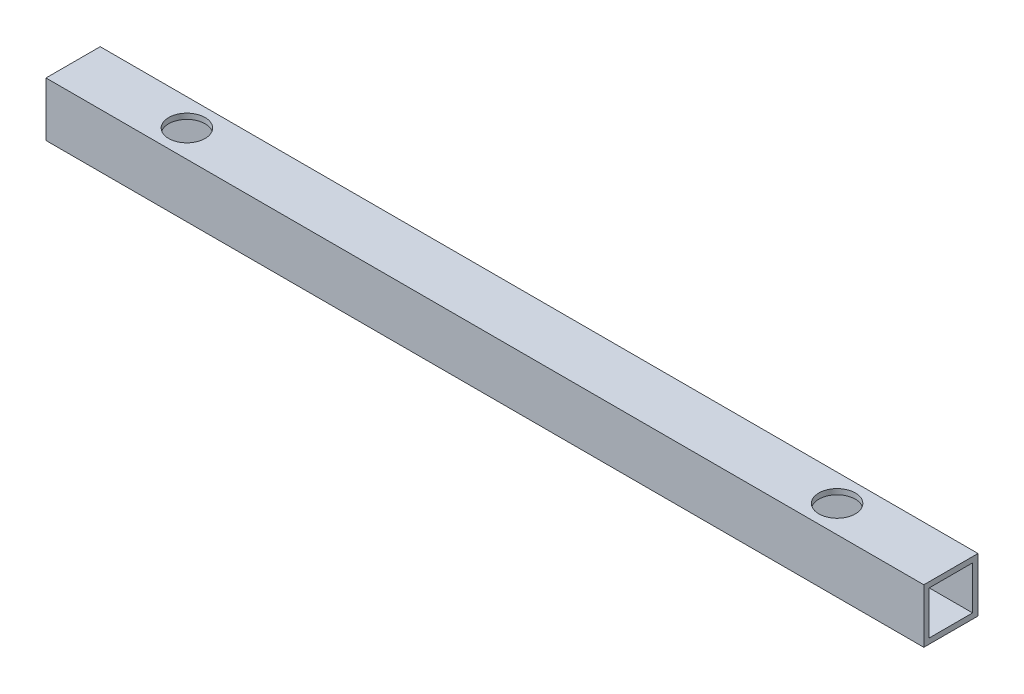
ISO-10303-21;
HEADER;
FILE_DESCRIPTION(('STEP AP214'),'2;1');
FILE_NAME('part.step','',(''),(''),'','','');
FILE_SCHEMA(('AUTOMOTIVE_DESIGN { 1 0 10303 214 1 1 1 1 }'));
ENDSEC;
DATA;
#1=APPLICATION_CONTEXT('core data for automotive mechanical design processes');
#2=APPLICATION_PROTOCOL_DEFINITION('international standard','automotive_design',2000,#1);
#3=PRODUCT_CONTEXT('',#1,'mechanical');
#4=PRODUCT('Part','Part','',(#3));
#5=PRODUCT_RELATED_PRODUCT_CATEGORY('part','',(#4));
#6=PRODUCT_DEFINITION_FORMATION('','',#4);
#7=PRODUCT_DEFINITION_CONTEXT('part definition',#1,'design');
#8=PRODUCT_DEFINITION('design','',#6,#7);
#9=PRODUCT_DEFINITION_SHAPE('','',#8);
#10=(LENGTH_UNIT() NAMED_UNIT(*) SI_UNIT(.MILLI.,.METRE.));
#11=(NAMED_UNIT(*) PLANE_ANGLE_UNIT() SI_UNIT($,.RADIAN.));
#12=(NAMED_UNIT(*) SI_UNIT($,.STERADIAN.) SOLID_ANGLE_UNIT());
#13=UNCERTAINTY_MEASURE_WITH_UNIT(LENGTH_MEASURE(1.E-05),#10,'distance_accuracy_value','');
#14=(GEOMETRIC_REPRESENTATION_CONTEXT(3) GLOBAL_UNCERTAINTY_ASSIGNED_CONTEXT((#13)) GLOBAL_UNIT_ASSIGNED_CONTEXT((#10,
#11,#12)) REPRESENTATION_CONTEXT('',''));
#15=CARTESIAN_POINT('',(0.,0.,0.));
#16=DIRECTION('',(0.,0.,1.));
#17=DIRECTION('',(1.,0.,0.));
#18=AXIS2_PLACEMENT_3D('',#15,#16,#17);
#19=CARTESIAN_POINT('',(66.675,0.,-15.875));
#20=DIRECTION('',(0.,1.,0.));
#21=DIRECTION('',(0.,0.,1.));
#22=AXIS2_PLACEMENT_3D('',#19,#20,#21);
#23=CYLINDRICAL_SURFACE('',#22,10.668);
#24=CARTESIAN_POINT('',(66.675,-28.575,-15.875));
#25=DIRECTION('',(0.,1.,0.));
#26=DIRECTION('',(0.,0.,1.));
#27=AXIS2_PLACEMENT_3D('',#24,#25,#26);
#28=CIRCLE('',#27,10.668);
#29=CARTESIAN_POINT('',(66.675,-28.575,-5.207));
#30=VERTEX_POINT('',#29);
#31=EDGE_CURVE('E20',#30,#30,#28,.F.);
#32=ORIENTED_EDGE('',*,*,#31,.F.);
#33=EDGE_LOOP('',(#32));
#34=FACE_BOUND('',#33,.T.);
#35=CARTESIAN_POINT('',(66.675,-31.75,-15.875));
#36=DIRECTION('',(0.,1.,0.));
#37=DIRECTION('',(0.,0.,1.));
#38=AXIS2_PLACEMENT_3D('',#35,#36,#37);
#39=CIRCLE('',#38,10.668);
#40=CARTESIAN_POINT('',(66.675,-31.75,-5.207));
#41=VERTEX_POINT('',#40);
#42=EDGE_CURVE('E120',#41,#41,#39,.T.);
#43=ORIENTED_EDGE('',*,*,#42,.F.);
#44=EDGE_LOOP('',(#43));
#45=FACE_BOUND('',#44,.T.);
#46=ADVANCED_FACE('F17',(#34,#45),#23,.F.);
#47=CARTESIAN_POINT('',(447.675,0.,-15.875));
#48=DIRECTION('',(0.,1.,0.));
#49=DIRECTION('',(0.,0.,1.));
#50=AXIS2_PLACEMENT_3D('',#47,#48,#49);
#51=CYLINDRICAL_SURFACE('',#50,10.668);
#52=CARTESIAN_POINT('',(447.675,-28.575,-15.875));
#53=DIRECTION('',(0.,1.,0.));
#54=DIRECTION('',(0.,0.,1.));
#55=AXIS2_PLACEMENT_3D('',#52,#53,#54);
#56=CIRCLE('',#55,10.668);
#57=CARTESIAN_POINT('',(447.675,-28.575,-5.207));
#58=VERTEX_POINT('',#57);
#59=EDGE_CURVE('E126',#58,#58,#56,.F.);
#60=ORIENTED_EDGE('',*,*,#59,.F.);
#61=EDGE_LOOP('',(#60));
#62=FACE_BOUND('',#61,.T.);
#63=CARTESIAN_POINT('',(447.675,-31.75,-15.875));
#64=DIRECTION('',(0.,1.,0.));
#65=DIRECTION('',(0.,0.,1.));
#66=AXIS2_PLACEMENT_3D('',#63,#64,#65);
#67=CIRCLE('',#66,10.668);
#68=CARTESIAN_POINT('',(447.675,-31.75,-5.207));
#69=VERTEX_POINT('',#68);
#70=EDGE_CURVE('E116',#69,#69,#67,.T.);
#71=ORIENTED_EDGE('',*,*,#70,.F.);
#72=EDGE_LOOP('',(#71));
#73=FACE_BOUND('',#72,.T.);
#74=ADVANCED_FACE('F153',(#62,#73),#51,.F.);
#75=CARTESIAN_POINT('',(66.675,0.,-15.875));
#76=DIRECTION('',(0.,1.,0.));
#77=DIRECTION('',(0.,0.,1.));
#78=AXIS2_PLACEMENT_3D('',#75,#76,#77);
#79=CYLINDRICAL_SURFACE('',#78,10.668);
#80=CARTESIAN_POINT('',(66.675,-3.175,-15.875));
#81=DIRECTION('',(0.,1.,0.));
#82=DIRECTION('',(0.,0.,1.));
#83=AXIS2_PLACEMENT_3D('',#80,#81,#82);
#84=CIRCLE('',#83,10.668);
#85=CARTESIAN_POINT('',(66.675,-3.175,-5.207));
#86=VERTEX_POINT('',#85);
#87=EDGE_CURVE('E91',#86,#86,#84,.T.);
#88=ORIENTED_EDGE('',*,*,#87,.F.);
#89=EDGE_LOOP('',(#88));
#90=FACE_BOUND('',#89,.T.);
#91=CARTESIAN_POINT('',(66.675,0.,-15.875));
#92=DIRECTION('',(0.,1.,0.));
#93=DIRECTION('',(0.,0.,1.));
#94=AXIS2_PLACEMENT_3D('',#91,#92,#93);
#95=CIRCLE('',#94,10.668);
#96=CARTESIAN_POINT('',(66.675,0.,-5.207));
#97=VERTEX_POINT('',#96);
#98=EDGE_CURVE('E131',#97,#97,#95,.F.);
#99=ORIENTED_EDGE('',*,*,#98,.F.);
#100=EDGE_LOOP('',(#99));
#101=FACE_BOUND('',#100,.T.);
#102=ADVANCED_FACE('F229',(#90,#101),#79,.F.);
#103=CARTESIAN_POINT('',(447.675,0.,-15.875));
#104=DIRECTION('',(0.,1.,0.));
#105=DIRECTION('',(0.,0.,1.));
#106=AXIS2_PLACEMENT_3D('',#103,#104,#105);
#107=CYLINDRICAL_SURFACE('',#106,10.668);
#108=CARTESIAN_POINT('',(447.675,-3.175,-15.875));
#109=DIRECTION('',(0.,1.,0.));
#110=DIRECTION('',(0.,0.,1.));
#111=AXIS2_PLACEMENT_3D('',#108,#109,#110);
#112=CIRCLE('',#111,10.668);
#113=CARTESIAN_POINT('',(447.675,-3.175,-5.207));
#114=VERTEX_POINT('',#113);
#115=EDGE_CURVE('E123',#114,#114,#112,.T.);
#116=ORIENTED_EDGE('',*,*,#115,.F.);
#117=EDGE_LOOP('',(#116));
#118=FACE_BOUND('',#117,.T.);
#119=CARTESIAN_POINT('',(447.675,0.,-15.875));
#120=DIRECTION('',(0.,1.,0.));
#121=DIRECTION('',(0.,0.,1.));
#122=AXIS2_PLACEMENT_3D('',#119,#120,#121);
#123=CIRCLE('',#122,10.668);
#124=CARTESIAN_POINT('',(447.675,0.,-5.207));
#125=VERTEX_POINT('',#124);
#126=EDGE_CURVE('E127',#125,#125,#123,.F.);
#127=ORIENTED_EDGE('',*,*,#126,.F.);
#128=EDGE_LOOP('',(#127));
#129=FACE_BOUND('',#128,.T.);
#130=ADVANCED_FACE('F225',(#118,#129),#107,.F.);
#131=CARTESIAN_POINT('',(0.,-31.75,-31.75));
#132=DIRECTION('',(0.,0.,-1.));
#133=DIRECTION('',(-1.,0.,0.));
#134=AXIS2_PLACEMENT_3D('',#131,#132,#133);
#135=PLANE('',#134);
#136=DIRECTION('',(1.,0.,0.));
#137=VECTOR('',#136,1.);
#138=CARTESIAN_POINT('',(0.,-31.75,-31.75));
#139=LINE('',#138,#137);
#140=CARTESIAN_POINT('',(0.,-31.75,-31.75));
#141=VERTEX_POINT('',#140);
#142=CARTESIAN_POINT('',(514.35,-31.75,-31.75));
#143=VERTEX_POINT('',#142);
#144=EDGE_CURVE('E117',#141,#143,#139,.T.);
#145=ORIENTED_EDGE('',*,*,#144,.F.);
#146=DIRECTION('',(0.,1.,0.));
#147=VECTOR('',#146,1.);
#148=CARTESIAN_POINT('',(0.,0.,-31.75));
#149=LINE('',#148,#147);
#150=CARTESIAN_POINT('',(0.,0.,-31.75));
#151=VERTEX_POINT('',#150);
#152=EDGE_CURVE('E176',#141,#151,#149,.T.);
#153=ORIENTED_EDGE('',*,*,#152,.T.);
#154=DIRECTION('',(1.,0.,0.));
#155=VECTOR('',#154,1.);
#156=CARTESIAN_POINT('',(0.,0.,-31.75));
#157=LINE('',#156,#155);
#158=CARTESIAN_POINT('',(514.35,0.,-31.75));
#159=VERTEX_POINT('',#158);
#160=EDGE_CURVE('E134',#159,#151,#157,.F.);
#161=ORIENTED_EDGE('',*,*,#160,.F.);
#162=DIRECTION('',(0.,1.,0.));
#163=VECTOR('',#162,1.);
#164=CARTESIAN_POINT('',(514.35,0.,-31.75));
#165=LINE('',#164,#163);
#166=EDGE_CURVE('E108',#143,#159,#165,.T.);
#167=ORIENTED_EDGE('',*,*,#166,.F.);
#168=EDGE_LOOP('',(#145,#153,#161,#167));
#169=FACE_BOUND('',#168,.T.);
#170=ADVANCED_FACE('F222',(#169),#135,.T.);
#171=CARTESIAN_POINT('',(0.,-28.575,-28.575));
#172=DIRECTION('',(0.,1.,0.));
#173=DIRECTION('',(0.,0.,1.));
#174=AXIS2_PLACEMENT_3D('',#171,#172,#173);
#175=PLANE('',#174);
#176=ORIENTED_EDGE('',*,*,#59,.T.);
#177=EDGE_LOOP('',(#176));
#178=FACE_BOUND('',#177,.T.);
#179=ORIENTED_EDGE('',*,*,#31,.T.);
#180=EDGE_LOOP('',(#179));
#181=FACE_BOUND('',#180,.T.);
#182=DIRECTION('',(1.,0.,0.));
#183=VECTOR('',#182,1.);
#184=CARTESIAN_POINT('',(0.,-28.575,-28.575));
#185=LINE('',#184,#183);
#186=CARTESIAN_POINT('',(0.,-28.575,-28.575));
#187=VERTEX_POINT('',#186);
#188=CARTESIAN_POINT('',(514.35,-28.575,-28.575));
#189=VERTEX_POINT('',#188);
#190=EDGE_CURVE('E122',#187,#189,#185,.T.);
#191=ORIENTED_EDGE('',*,*,#190,.F.);
#192=DIRECTION('',(0.,0.,-1.));
#193=VECTOR('',#192,1.);
#194=CARTESIAN_POINT('',(0.,-28.575,0.));
#195=LINE('',#194,#193);
#196=CARTESIAN_POINT('',(0.,-28.575,-3.175));
#197=VERTEX_POINT('',#196);
#198=EDGE_CURVE('E188',#187,#197,#195,.F.);
#199=ORIENTED_EDGE('',*,*,#198,.T.);
#200=DIRECTION('',(-1.,0.,0.));
#201=VECTOR('',#200,1.);
#202=CARTESIAN_POINT('',(0.,-28.575,-3.175));
#203=LINE('',#202,#201);
#204=CARTESIAN_POINT('',(514.35,-28.575,-3.175));
#205=VERTEX_POINT('',#204);
#206=EDGE_CURVE('E92',#205,#197,#203,.T.);
#207=ORIENTED_EDGE('',*,*,#206,.F.);
#208=DIRECTION('',(0.,0.,-1.));
#209=VECTOR('',#208,1.);
#210=CARTESIAN_POINT('',(514.35,-28.575,0.));
#211=LINE('',#210,#209);
#212=EDGE_CURVE('E107',#189,#205,#211,.F.);
#213=ORIENTED_EDGE('',*,*,#212,.F.);
#214=EDGE_LOOP('',(#191,#199,#207,#213));
#215=FACE_BOUND('',#214,.T.);
#216=ADVANCED_FACE('F148',(#178,#181,#215),#175,.T.);
#217=CARTESIAN_POINT('',(0.,-28.575,-3.175));
#218=DIRECTION('',(0.,0.,-1.));
#219=DIRECTION('',(-1.,0.,0.));
#220=AXIS2_PLACEMENT_3D('',#217,#218,#219);
#221=PLANE('',#220);
#222=ORIENTED_EDGE('',*,*,#206,.T.);
#223=DIRECTION('',(0.,1.,0.));
#224=VECTOR('',#223,1.);
#225=CARTESIAN_POINT('',(0.,0.,-3.175));
#226=LINE('',#225,#224);
#227=CARTESIAN_POINT('',(0.,-3.175,-3.175));
#228=VERTEX_POINT('',#227);
#229=EDGE_CURVE('E88',#197,#228,#226,.T.);
#230=ORIENTED_EDGE('',*,*,#229,.T.);
#231=DIRECTION('',(1.,0.,0.));
#232=VECTOR('',#231,1.);
#233=CARTESIAN_POINT('',(0.,-3.175,-3.175));
#234=LINE('',#233,#232);
#235=CARTESIAN_POINT('',(514.35,-3.175,-3.175));
#236=VERTEX_POINT('',#235);
#237=EDGE_CURVE('E80',#236,#228,#234,.F.);
#238=ORIENTED_EDGE('',*,*,#237,.F.);
#239=DIRECTION('',(0.,1.,0.));
#240=VECTOR('',#239,1.);
#241=CARTESIAN_POINT('',(514.35,0.,-3.175));
#242=LINE('',#241,#240);
#243=EDGE_CURVE('E85',#205,#236,#242,.T.);
#244=ORIENTED_EDGE('',*,*,#243,.F.);
#245=EDGE_LOOP('',(#222,#230,#238,#244));
#246=FACE_BOUND('',#245,.T.);
#247=ADVANCED_FACE('F83',(#246),#221,.T.);
#248=CARTESIAN_POINT('',(0.,-3.175,-3.175));
#249=DIRECTION('',(0.,-1.,0.));
#250=DIRECTION('',(0.,0.,-1.));
#251=AXIS2_PLACEMENT_3D('',#248,#249,#250);
#252=PLANE('',#251);
#253=ORIENTED_EDGE('',*,*,#115,.T.);
#254=EDGE_LOOP('',(#253));
#255=FACE_BOUND('',#254,.T.);
#256=ORIENTED_EDGE('',*,*,#87,.T.);
#257=EDGE_LOOP('',(#256));
#258=FACE_BOUND('',#257,.T.);
#259=ORIENTED_EDGE('',*,*,#237,.T.);
#260=DIRECTION('',(0.,0.,-1.));
#261=VECTOR('',#260,1.);
#262=CARTESIAN_POINT('',(0.,-3.175,0.));
#263=LINE('',#262,#261);
#264=CARTESIAN_POINT('',(0.,-3.175,-28.575));
#265=VERTEX_POINT('',#264);
#266=EDGE_CURVE('E185',#228,#265,#263,.T.);
#267=ORIENTED_EDGE('',*,*,#266,.T.);
#268=DIRECTION('',(1.,0.,0.));
#269=VECTOR('',#268,1.);
#270=CARTESIAN_POINT('',(0.,-3.175,-28.575));
#271=LINE('',#270,#269);
#272=CARTESIAN_POINT('',(514.35,-3.175,-28.575));
#273=VERTEX_POINT('',#272);
#274=EDGE_CURVE('E98',#273,#265,#271,.F.);
#275=ORIENTED_EDGE('',*,*,#274,.F.);
#276=DIRECTION('',(0.,0.,-1.));
#277=VECTOR('',#276,1.);
#278=CARTESIAN_POINT('',(514.35,-3.175,0.));
#279=LINE('',#278,#277);
#280=EDGE_CURVE('E95',#236,#273,#279,.T.);
#281=ORIENTED_EDGE('',*,*,#280,.F.);
#282=EDGE_LOOP('',(#259,#267,#275,#281));
#283=FACE_BOUND('',#282,.T.);
#284=ADVANCED_FACE('F96',(#255,#258,#283),#252,.T.);
#285=CARTESIAN_POINT('',(0.,-3.175,-28.575));
#286=DIRECTION('',(0.,0.,1.));
#287=DIRECTION('',(1.,0.,0.));
#288=AXIS2_PLACEMENT_3D('',#285,#286,#287);
#289=PLANE('',#288);
#290=ORIENTED_EDGE('',*,*,#274,.T.);
#291=DIRECTION('',(0.,1.,0.));
#292=VECTOR('',#291,1.);
#293=CARTESIAN_POINT('',(0.,0.,-28.575));
#294=LINE('',#293,#292);
#295=EDGE_CURVE('E171',#265,#187,#294,.F.);
#296=ORIENTED_EDGE('',*,*,#295,.T.);
#297=ORIENTED_EDGE('',*,*,#190,.T.);
#298=DIRECTION('',(0.,1.,0.));
#299=VECTOR('',#298,1.);
#300=CARTESIAN_POINT('',(514.35,0.,-28.575));
#301=LINE('',#300,#299);
#302=EDGE_CURVE('E102',#273,#189,#301,.F.);
#303=ORIENTED_EDGE('',*,*,#302,.F.);
#304=EDGE_LOOP('',(#290,#296,#297,#303));
#305=FACE_BOUND('',#304,.T.);
#306=ADVANCED_FACE('F159',(#305),#289,.T.);
#307=CARTESIAN_POINT('',(0.,-31.75,0.));
#308=DIRECTION('',(0.,-1.,0.));
#309=DIRECTION('',(0.,0.,-1.));
#310=AXIS2_PLACEMENT_3D('',#307,#308,#309);
#311=PLANE('',#310);
#312=ORIENTED_EDGE('',*,*,#70,.T.);
#313=EDGE_LOOP('',(#312));
#314=FACE_BOUND('',#313,.T.);
#315=ORIENTED_EDGE('',*,*,#42,.T.);
#316=EDGE_LOOP('',(#315));
#317=FACE_BOUND('',#316,.T.);
#318=DIRECTION('',(1.,0.,0.));
#319=VECTOR('',#318,1.);
#320=CARTESIAN_POINT('',(0.,-31.75,0.));
#321=LINE('',#320,#319);
#322=CARTESIAN_POINT('',(0.,-31.75,0.));
#323=VERTEX_POINT('',#322);
#324=CARTESIAN_POINT('',(514.35,-31.75,0.));
#325=VERTEX_POINT('',#324);
#326=EDGE_CURVE('E164',#323,#325,#321,.T.);
#327=ORIENTED_EDGE('',*,*,#326,.F.);
#328=DIRECTION('',(0.,0.,-1.));
#329=VECTOR('',#328,1.);
#330=CARTESIAN_POINT('',(0.,-31.75,0.));
#331=LINE('',#330,#329);
#332=EDGE_CURVE('E130',#323,#141,#331,.T.);
#333=ORIENTED_EDGE('',*,*,#332,.T.);
#334=ORIENTED_EDGE('',*,*,#144,.T.);
#335=DIRECTION('',(0.,0.,-1.));
#336=VECTOR('',#335,1.);
#337=CARTESIAN_POINT('',(514.35,-31.75,0.));
#338=LINE('',#337,#336);
#339=EDGE_CURVE('E110',#325,#143,#338,.T.);
#340=ORIENTED_EDGE('',*,*,#339,.F.);
#341=EDGE_LOOP('',(#327,#333,#334,#340));
#342=FACE_BOUND('',#341,.T.);
#343=ADVANCED_FACE('F156',(#314,#317,#342),#311,.T.);
#344=CARTESIAN_POINT('',(514.35,0.,0.));
#345=DIRECTION('',(1.,0.,0.));
#346=DIRECTION('',(0.,0.,-1.));
#347=AXIS2_PLACEMENT_3D('',#344,#345,#346);
#348=PLANE('',#347);
#349=ORIENTED_EDGE('',*,*,#302,.T.);
#350=ORIENTED_EDGE('',*,*,#212,.T.);
#351=ORIENTED_EDGE('',*,*,#243,.T.);
#352=ORIENTED_EDGE('',*,*,#280,.T.);
#353=EDGE_LOOP('',(#349,#350,#351,#352));
#354=FACE_BOUND('',#353,.T.);
#355=DIRECTION('',(0.,0.,1.));
#356=VECTOR('',#355,1.);
#357=CARTESIAN_POINT('',(514.35,0.,-31.75));
#358=LINE('',#357,#356);
#359=CARTESIAN_POINT('',(514.35,0.,0.));
#360=VERTEX_POINT('',#359);
#361=EDGE_CURVE('E193',#360,#159,#358,.F.);
#362=ORIENTED_EDGE('',*,*,#361,.F.);
#363=DIRECTION('',(0.,1.,0.));
#364=VECTOR('',#363,1.);
#365=CARTESIAN_POINT('',(514.35,0.,0.));
#366=LINE('',#365,#364);
#367=EDGE_CURVE('E170',#325,#360,#366,.T.);
#368=ORIENTED_EDGE('',*,*,#367,.F.);
#369=ORIENTED_EDGE('',*,*,#339,.T.);
#370=ORIENTED_EDGE('',*,*,#166,.T.);
#371=EDGE_LOOP('',(#362,#368,#369,#370));
#372=FACE_BOUND('',#371,.T.);
#373=ADVANCED_FACE('F104',(#354,#372),#348,.T.);
#374=CARTESIAN_POINT('',(0.,0.,-31.75));
#375=DIRECTION('',(0.,1.,0.));
#376=DIRECTION('',(0.,0.,1.));
#377=AXIS2_PLACEMENT_3D('',#374,#375,#376);
#378=PLANE('',#377);
#379=ORIENTED_EDGE('',*,*,#126,.T.);
#380=EDGE_LOOP('',(#379));
#381=FACE_BOUND('',#380,.T.);
#382=ORIENTED_EDGE('',*,*,#98,.T.);
#383=EDGE_LOOP('',(#382));
#384=FACE_BOUND('',#383,.T.);
#385=ORIENTED_EDGE('',*,*,#160,.T.);
#386=DIRECTION('',(0.,0.,-1.));
#387=VECTOR('',#386,1.);
#388=CARTESIAN_POINT('',(0.,0.,0.));
#389=LINE('',#388,#387);
#390=CARTESIAN_POINT('',(0.,0.,0.));
#391=VERTEX_POINT('',#390);
#392=EDGE_CURVE('E35',#151,#391,#389,.F.);
#393=ORIENTED_EDGE('',*,*,#392,.T.);
#394=DIRECTION('',(1.,0.,0.));
#395=VECTOR('',#394,1.);
#396=CARTESIAN_POINT('',(0.,0.,0.));
#397=LINE('',#396,#395);
#398=EDGE_CURVE('E26',#360,#391,#397,.F.);
#399=ORIENTED_EDGE('',*,*,#398,.F.);
#400=ORIENTED_EDGE('',*,*,#361,.T.);
#401=EDGE_LOOP('',(#385,#393,#399,#400));
#402=FACE_BOUND('',#401,.T.);
#403=ADVANCED_FACE('F200',(#381,#384,#402),#378,.T.);
#404=CARTESIAN_POINT('',(0.,0.,0.));
#405=DIRECTION('',(1.,0.,0.));
#406=DIRECTION('',(0.,0.,-1.));
#407=AXIS2_PLACEMENT_3D('',#404,#405,#406);
#408=PLANE('',#407);
#409=ORIENTED_EDGE('',*,*,#266,.F.);
#410=ORIENTED_EDGE('',*,*,#229,.F.);
#411=ORIENTED_EDGE('',*,*,#198,.F.);
#412=ORIENTED_EDGE('',*,*,#295,.F.);
#413=EDGE_LOOP('',(#409,#410,#411,#412));
#414=FACE_BOUND('',#413,.T.);
#415=ORIENTED_EDGE('',*,*,#152,.F.);
#416=ORIENTED_EDGE('',*,*,#332,.F.);
#417=DIRECTION('',(0.,1.,0.));
#418=VECTOR('',#417,1.);
#419=CARTESIAN_POINT('',(0.,0.,0.));
#420=LINE('',#419,#418);
#421=EDGE_CURVE('E11',#391,#323,#420,.F.);
#422=ORIENTED_EDGE('',*,*,#421,.F.);
#423=ORIENTED_EDGE('',*,*,#392,.F.);
#424=EDGE_LOOP('',(#415,#416,#422,#423));
#425=FACE_BOUND('',#424,.T.);
#426=ADVANCED_FACE('F174',(#414,#425),#408,.F.);
#427=CARTESIAN_POINT('',(0.,0.,0.));
#428=DIRECTION('',(0.,0.,1.));
#429=DIRECTION('',(1.,0.,0.));
#430=AXIS2_PLACEMENT_3D('',#427,#428,#429);
#431=PLANE('',#430);
#432=ORIENTED_EDGE('',*,*,#398,.T.);
#433=ORIENTED_EDGE('',*,*,#421,.T.);
#434=ORIENTED_EDGE('',*,*,#326,.T.);
#435=ORIENTED_EDGE('',*,*,#367,.T.);
#436=EDGE_LOOP('',(#432,#433,#434,#435));
#437=FACE_BOUND('',#436,.T.);
#438=ADVANCED_FACE('F178',(#437),#431,.T.);
#439=CLOSED_SHELL('',(#46,#74,#102,#130,#170,#216,#247,#284,#306,#343,#373,#403,#426,#438));
#440=MANIFOLD_SOLID_BREP('B1',#439);
#441=ADVANCED_BREP_SHAPE_REPRESENTATION('',(#18,#440),#14);
#442=SHAPE_DEFINITION_REPRESENTATION(#9,#441);
ENDSEC;
END-ISO-10303-21;
